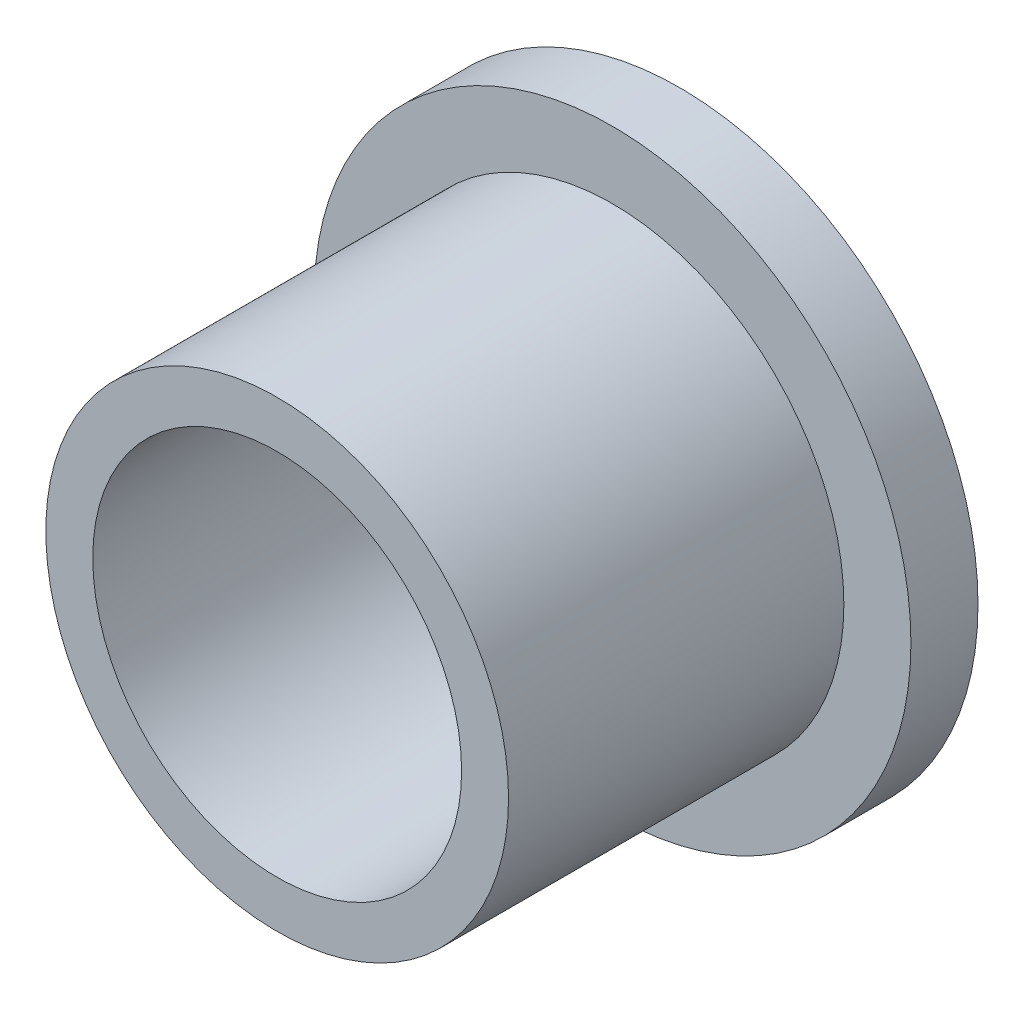
ISO-10303-21;
HEADER;
FILE_DESCRIPTION(('STEP AP214'),'2;1');
FILE_NAME('part.step','',(''),(''),'','','');
FILE_SCHEMA(('AUTOMOTIVE_DESIGN { 1 0 10303 214 1 1 1 1 }'));
ENDSEC;
DATA;
#1=APPLICATION_CONTEXT('core data for automotive mechanical design processes');
#2=APPLICATION_PROTOCOL_DEFINITION('international standard','automotive_design',2000,#1);
#3=PRODUCT_CONTEXT('',#1,'mechanical');
#4=PRODUCT('Part','Part','',(#3));
#5=PRODUCT_RELATED_PRODUCT_CATEGORY('part','',(#4));
#6=PRODUCT_DEFINITION_FORMATION('','',#4);
#7=PRODUCT_DEFINITION_CONTEXT('part definition',#1,'design');
#8=PRODUCT_DEFINITION('design','',#6,#7);
#9=PRODUCT_DEFINITION_SHAPE('','',#8);
#10=(LENGTH_UNIT() NAMED_UNIT(*) SI_UNIT(.MILLI.,.METRE.));
#11=(NAMED_UNIT(*) PLANE_ANGLE_UNIT() SI_UNIT($,.RADIAN.));
#12=(NAMED_UNIT(*) SI_UNIT($,.STERADIAN.) SOLID_ANGLE_UNIT());
#13=UNCERTAINTY_MEASURE_WITH_UNIT(LENGTH_MEASURE(1.E-05),#10,'distance_accuracy_value','');
#14=(GEOMETRIC_REPRESENTATION_CONTEXT(3) GLOBAL_UNCERTAINTY_ASSIGNED_CONTEXT((#13)) GLOBAL_UNIT_ASSIGNED_CONTEXT((#10,
#11,#12)) REPRESENTATION_CONTEXT('',''));
#15=CARTESIAN_POINT('',(0.,0.,0.));
#16=DIRECTION('',(0.,0.,1.));
#17=DIRECTION('',(1.,0.,0.));
#18=AXIS2_PLACEMENT_3D('',#15,#16,#17);
#19=CARTESIAN_POINT('',(0.,0.,10.3909365766508));
#20=DIRECTION('',(0.,0.,1.));
#21=DIRECTION('',(1.,0.,0.));
#22=AXIS2_PLACEMENT_3D('',#19,#20,#21);
#23=PLANE('',#22);
#24=CARTESIAN_POINT('',(0.,0.,10.3909365766508));
#25=DIRECTION('',(0.,0.,1.));
#26=DIRECTION('',(1.,0.,0.));
#27=AXIS2_PLACEMENT_3D('',#24,#25,#26);
#28=CIRCLE('',#27,2.75);
#29=CARTESIAN_POINT('',(2.75,0.,10.3909365766508));
#30=VERTEX_POINT('',#29);
#31=EDGE_CURVE('E52',#30,#30,#28,.T.);
#32=ORIENTED_EDGE('',*,*,#31,.F.);
#33=EDGE_LOOP('',(#32));
#34=FACE_BOUND('',#33,.T.);
#35=CARTESIAN_POINT('',(0.,0.,10.3909365766508));
#36=DIRECTION('',(0.,0.,1.));
#37=DIRECTION('',(1.,0.,0.));
#38=AXIS2_PLACEMENT_3D('',#35,#36,#37);
#39=CIRCLE('',#38,3.45);
#40=CARTESIAN_POINT('',(3.45,0.,10.3909365766508));
#41=VERTEX_POINT('',#40);
#42=EDGE_CURVE('E10',#41,#41,#39,.T.);
#43=ORIENTED_EDGE('',*,*,#42,.T.);
#44=EDGE_LOOP('',(#43));
#45=FACE_BOUND('',#44,.T.);
#46=ADVANCED_FACE('F33',(#34,#45),#23,.T.);
#47=CARTESIAN_POINT('',(0.,0.,12.0726937030327));
#48=DIRECTION('',(0.,0.,1.));
#49=DIRECTION('',(1.,0.,0.));
#50=AXIS2_PLACEMENT_3D('',#47,#48,#49);
#51=CYLINDRICAL_SURFACE('',#50,3.45);
#52=ORIENTED_EDGE('',*,*,#42,.F.);
#53=EDGE_LOOP('',(#52));
#54=FACE_BOUND('',#53,.T.);
#55=CARTESIAN_POINT('',(0.,0.,5.39093657665082));
#56=DIRECTION('',(0.,0.,1.));
#57=DIRECTION('',(1.,0.,0.));
#58=AXIS2_PLACEMENT_3D('',#55,#56,#57);
#59=CIRCLE('',#58,3.45);
#60=CARTESIAN_POINT('',(3.45,0.,5.39093657665082));
#61=VERTEX_POINT('',#60);
#62=EDGE_CURVE('E40',#61,#61,#59,.T.);
#63=ORIENTED_EDGE('',*,*,#62,.T.);
#64=EDGE_LOOP('',(#63));
#65=FACE_BOUND('',#64,.T.);
#66=ADVANCED_FACE('F71',(#54,#65),#51,.T.);
#67=CARTESIAN_POINT('',(0.,0.,5.39093657665082));
#68=DIRECTION('',(0.,0.,-1.));
#69=DIRECTION('',(-1.,0.,0.));
#70=AXIS2_PLACEMENT_3D('',#67,#68,#69);
#71=PLANE('',#70);
#72=ORIENTED_EDGE('',*,*,#62,.F.);
#73=EDGE_LOOP('',(#72));
#74=FACE_BOUND('',#73,.T.);
#75=CARTESIAN_POINT('',(0.,0.,5.39093657665082));
#76=DIRECTION('',(0.,0.,1.));
#77=DIRECTION('',(1.,0.,0.));
#78=AXIS2_PLACEMENT_3D('',#75,#76,#77);
#79=CIRCLE('',#78,4.45);
#80=CARTESIAN_POINT('',(4.45,0.,5.39093657665082));
#81=VERTEX_POINT('',#80);
#82=EDGE_CURVE('E44',#81,#81,#79,.T.);
#83=ORIENTED_EDGE('',*,*,#82,.T.);
#84=EDGE_LOOP('',(#83));
#85=FACE_BOUND('',#84,.T.);
#86=ADVANCED_FACE('F76',(#74,#85),#71,.F.);
#87=CARTESIAN_POINT('',(0.,0.,12.0726937030327));
#88=DIRECTION('',(0.,0.,1.));
#89=DIRECTION('',(1.,0.,0.));
#90=AXIS2_PLACEMENT_3D('',#87,#88,#89);
#91=CYLINDRICAL_SURFACE('',#90,4.45);
#92=ORIENTED_EDGE('',*,*,#82,.F.);
#93=EDGE_LOOP('',(#92));
#94=FACE_BOUND('',#93,.T.);
#95=CARTESIAN_POINT('',(0.,0.,4.39093657665082));
#96=DIRECTION('',(0.,0.,1.));
#97=DIRECTION('',(1.,0.,0.));
#98=AXIS2_PLACEMENT_3D('',#95,#96,#97);
#99=CIRCLE('',#98,4.45);
#100=CARTESIAN_POINT('',(4.45,0.,4.39093657665082));
#101=VERTEX_POINT('',#100);
#102=EDGE_CURVE('E49',#101,#101,#99,.T.);
#103=ORIENTED_EDGE('',*,*,#102,.T.);
#104=EDGE_LOOP('',(#103));
#105=FACE_BOUND('',#104,.T.);
#106=ADVANCED_FACE('F68',(#94,#105),#91,.T.);
#107=CARTESIAN_POINT('',(0.,0.,4.39093657665082));
#108=DIRECTION('',(0.,0.,1.));
#109=DIRECTION('',(1.,0.,0.));
#110=AXIS2_PLACEMENT_3D('',#107,#108,#109);
#111=PLANE('',#110);
#112=CARTESIAN_POINT('',(0.,0.,4.39093657665082));
#113=DIRECTION('',(0.,0.,1.));
#114=DIRECTION('',(1.,0.,0.));
#115=AXIS2_PLACEMENT_3D('',#112,#113,#114);
#116=CIRCLE('',#115,2.75);
#117=CARTESIAN_POINT('',(2.75,0.,4.39093657665082));
#118=VERTEX_POINT('',#117);
#119=EDGE_CURVE('E36',#118,#118,#116,.T.);
#120=ORIENTED_EDGE('',*,*,#119,.T.);
#121=EDGE_LOOP('',(#120));
#122=FACE_BOUND('',#121,.T.);
#123=ORIENTED_EDGE('',*,*,#102,.F.);
#124=EDGE_LOOP('',(#123));
#125=FACE_BOUND('',#124,.T.);
#126=ADVANCED_FACE('F59',(#122,#125),#111,.F.);
#127=CARTESIAN_POINT('',(0.,0.,0.390936576650824));
#128=DIRECTION('',(0.,0.,1.));
#129=DIRECTION('',(1.,0.,0.));
#130=AXIS2_PLACEMENT_3D('',#127,#128,#129);
#131=CYLINDRICAL_SURFACE('',#130,2.75);
#132=ORIENTED_EDGE('',*,*,#31,.T.);
#133=EDGE_LOOP('',(#132));
#134=FACE_BOUND('',#133,.T.);
#135=ORIENTED_EDGE('',*,*,#119,.F.);
#136=EDGE_LOOP('',(#135));
#137=FACE_BOUND('',#136,.T.);
#138=ADVANCED_FACE('F62',(#134,#137),#131,.F.);
#139=CLOSED_SHELL('',(#46,#66,#86,#106,#126,#138));
#140=MANIFOLD_SOLID_BREP('B2',#139);
#141=ADVANCED_BREP_SHAPE_REPRESENTATION('',(#18,#140),#14);
#142=SHAPE_DEFINITION_REPRESENTATION(#9,#141);
ENDSEC;
END-ISO-10303-21;
